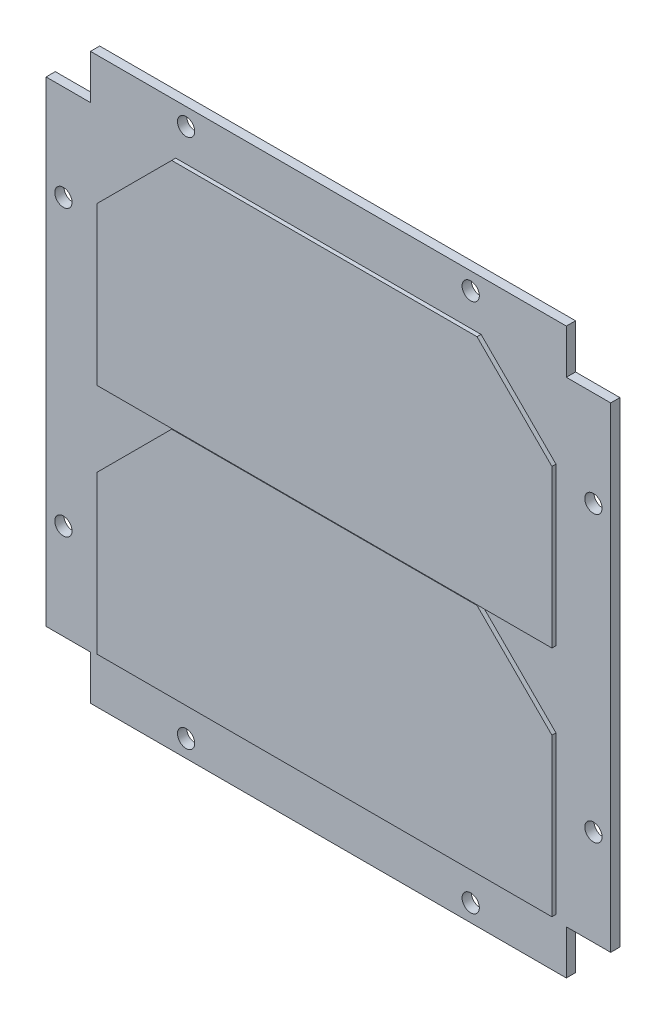
ISO-10303-21;
HEADER;
FILE_DESCRIPTION(('STEP AP214'),'2;1');
FILE_NAME('part.step','',(''),(''),'','','');
FILE_SCHEMA(('AUTOMOTIVE_DESIGN { 1 0 10303 214 1 1 1 1 }'));
ENDSEC;
DATA;
#1=APPLICATION_CONTEXT('core data for automotive mechanical design processes');
#2=APPLICATION_PROTOCOL_DEFINITION('international standard','automotive_design',2000,#1);
#3=PRODUCT_CONTEXT('',#1,'mechanical');
#4=PRODUCT('Part','Part','',(#3));
#5=PRODUCT_RELATED_PRODUCT_CATEGORY('part','',(#4));
#6=PRODUCT_DEFINITION_FORMATION('','',#4);
#7=PRODUCT_DEFINITION_CONTEXT('part definition',#1,'design');
#8=PRODUCT_DEFINITION('design','',#6,#7);
#9=PRODUCT_DEFINITION_SHAPE('','',#8);
#10=(LENGTH_UNIT() NAMED_UNIT(*) SI_UNIT(.MILLI.,.METRE.));
#11=(NAMED_UNIT(*) PLANE_ANGLE_UNIT() SI_UNIT($,.RADIAN.));
#12=(NAMED_UNIT(*) SI_UNIT($,.STERADIAN.) SOLID_ANGLE_UNIT());
#13=UNCERTAINTY_MEASURE_WITH_UNIT(LENGTH_MEASURE(1.E-05),#10,'distance_accuracy_value','');
#14=(GEOMETRIC_REPRESENTATION_CONTEXT(3) GLOBAL_UNCERTAINTY_ASSIGNED_CONTEXT((#13)) GLOBAL_UNIT_ASSIGNED_CONTEXT((#10,
#11,#12)) REPRESENTATION_CONTEXT('',''));
#15=CARTESIAN_POINT('',(0.,0.,0.));
#16=DIRECTION('',(0.,0.,1.));
#17=DIRECTION('',(1.,0.,0.));
#18=AXIS2_PLACEMENT_3D('',#15,#16,#17);
#19=CARTESIAN_POINT('',(0.,0.,1.6));
#20=DIRECTION('',(0.,0.,1.));
#21=DIRECTION('',(1.,0.,0.));
#22=AXIS2_PLACEMENT_3D('',#19,#20,#21);
#23=PLANE('',#22);
#24=CARTESIAN_POINT('',(0.817350233556478,40.8722046309123,1.6));
#25=DIRECTION('',(0.,0.,1.));
#26=DIRECTION('',(1.,0.,0.));
#27=AXIS2_PLACEMENT_3D('',#24,#25,#26);
#28=CIRCLE('',#27,1.5);
#29=CARTESIAN_POINT('',(2.31735023355648,40.8722046309123,1.6));
#30=VERTEX_POINT('',#29);
#31=EDGE_CURVE('E334',#30,#30,#28,.T.);
#32=ORIENTED_EDGE('',*,*,#31,.F.);
#33=EDGE_LOOP('',(#32));
#34=FACE_BOUND('',#33,.T.);
#35=CARTESIAN_POINT('',(22.1173502335565,-29.8277953690877,1.6));
#36=DIRECTION('',(0.,0.,1.));
#37=DIRECTION('',(1.,0.,0.));
#38=AXIS2_PLACEMENT_3D('',#35,#36,#37);
#39=CIRCLE('',#38,1.5);
#40=CARTESIAN_POINT('',(23.6173502335565,-29.8277953690877,1.6));
#41=VERTEX_POINT('',#40);
#42=EDGE_CURVE('E322',#41,#41,#39,.T.);
#43=ORIENTED_EDGE('',*,*,#42,.F.);
#44=EDGE_LOOP('',(#43));
#45=FACE_BOUND('',#44,.T.);
#46=CARTESIAN_POINT('',(-48.5826497664435,-51.1277953690877,1.6));
#47=DIRECTION('',(0.,0.,1.));
#48=DIRECTION('',(1.,0.,0.));
#49=AXIS2_PLACEMENT_3D('',#46,#47,#48);
#50=CIRCLE('',#49,1.5);
#51=CARTESIAN_POINT('',(-47.0826497664435,-51.1277953690877,1.6));
#52=VERTEX_POINT('',#51);
#53=EDGE_CURVE('E310',#52,#52,#50,.T.);
#54=ORIENTED_EDGE('',*,*,#53,.F.);
#55=EDGE_LOOP('',(#54));
#56=FACE_BOUND('',#55,.T.);
#57=CARTESIAN_POINT('',(-69.8826497664435,19.5722046309123,1.6));
#58=DIRECTION('',(0.,0.,1.));
#59=DIRECTION('',(1.,0.,0.));
#60=AXIS2_PLACEMENT_3D('',#57,#58,#59);
#61=CIRCLE('',#60,1.5);
#62=CARTESIAN_POINT('',(-68.3826497664435,19.5722046309123,1.6));
#63=VERTEX_POINT('',#62);
#64=EDGE_CURVE('E300',#63,#63,#61,.T.);
#65=ORIENTED_EDGE('',*,*,#64,.F.);
#66=EDGE_LOOP('',(#65));
#67=FACE_BOUND('',#66,.T.);
#68=DIRECTION('',(-1.,0.,0.));
#69=VECTOR('',#68,1.);
#70=CARTESIAN_POINT('',(17.4173502335565,43.8722046309123,1.6));
#71=LINE('',#70,#69);
#72=CARTESIAN_POINT('',(17.4173502335565,43.8722046309123,1.6));
#73=VERTEX_POINT('',#72);
#74=CARTESIAN_POINT('',(-65.1826497664435,43.8722046309123,1.6));
#75=VERTEX_POINT('',#74);
#76=EDGE_CURVE('E195',#73,#75,#71,.T.);
#77=ORIENTED_EDGE('',*,*,#76,.T.);
#78=DIRECTION('',(0.,-1.,0.));
#79=VECTOR('',#78,1.);
#80=CARTESIAN_POINT('',(-65.1826497664435,43.8722046309123,1.6));
#81=LINE('',#80,#79);
#82=CARTESIAN_POINT('',(-65.1826497664435,36.1722046309123,1.6));
#83=VERTEX_POINT('',#82);
#84=EDGE_CURVE('E118',#75,#83,#81,.T.);
#85=ORIENTED_EDGE('',*,*,#84,.T.);
#86=DIRECTION('',(-1.,0.,0.));
#87=VECTOR('',#86,1.);
#88=CARTESIAN_POINT('',(-65.1826497664435,36.1722046309123,1.6));
#89=LINE('',#88,#87);
#90=CARTESIAN_POINT('',(-72.8826497664435,36.1722046309123,1.6));
#91=VERTEX_POINT('',#90);
#92=EDGE_CURVE('E222',#83,#91,#89,.T.);
#93=ORIENTED_EDGE('',*,*,#92,.T.);
#94=DIRECTION('',(0.,-1.,0.));
#95=VECTOR('',#94,1.);
#96=CARTESIAN_POINT('',(-72.8826497664435,36.1722046309123,1.6));
#97=LINE('',#96,#95);
#98=CARTESIAN_POINT('',(-72.8826497664435,-46.4277953690877,1.6));
#99=VERTEX_POINT('',#98);
#100=EDGE_CURVE('E241',#91,#99,#97,.T.);
#101=ORIENTED_EDGE('',*,*,#100,.T.);
#102=DIRECTION('',(1.,0.,0.));
#103=VECTOR('',#102,1.);
#104=CARTESIAN_POINT('',(-72.8826497664435,-46.4277953690877,1.6));
#105=LINE('',#104,#103);
#106=CARTESIAN_POINT('',(-65.1826497664435,-46.4277953690877,1.6));
#107=VERTEX_POINT('',#106);
#108=EDGE_CURVE('E238',#99,#107,#105,.T.);
#109=ORIENTED_EDGE('',*,*,#108,.T.);
#110=DIRECTION('',(0.,-1.,0.));
#111=VECTOR('',#110,1.);
#112=CARTESIAN_POINT('',(-65.1826497664435,-46.4277953690877,1.6));
#113=LINE('',#112,#111);
#114=CARTESIAN_POINT('',(-65.1826497664435,-54.1277953690877,1.6));
#115=VERTEX_POINT('',#114);
#116=EDGE_CURVE('E240',#107,#115,#113,.T.);
#117=ORIENTED_EDGE('',*,*,#116,.T.);
#118=DIRECTION('',(1.,0.,0.));
#119=VECTOR('',#118,1.);
#120=CARTESIAN_POINT('',(-65.1826497664435,-54.1277953690877,1.6));
#121=LINE('',#120,#119);
#122=CARTESIAN_POINT('',(17.4173502335565,-54.1277953690877,1.6));
#123=VERTEX_POINT('',#122);
#124=EDGE_CURVE('E243',#115,#123,#121,.T.);
#125=ORIENTED_EDGE('',*,*,#124,.T.);
#126=DIRECTION('',(0.,1.,0.));
#127=VECTOR('',#126,1.);
#128=CARTESIAN_POINT('',(17.4173502335565,-54.1277953690877,1.6));
#129=LINE('',#128,#127);
#130=CARTESIAN_POINT('',(17.4173502335565,-46.4277953690877,1.6));
#131=VERTEX_POINT('',#130);
#132=EDGE_CURVE('E249',#123,#131,#129,.T.);
#133=ORIENTED_EDGE('',*,*,#132,.T.);
#134=DIRECTION('',(1.,0.,0.));
#135=VECTOR('',#134,1.);
#136=CARTESIAN_POINT('',(17.4173502335565,-46.4277953690877,1.6));
#137=LINE('',#136,#135);
#138=CARTESIAN_POINT('',(25.1173502335565,-46.4277953690877,1.6));
#139=VERTEX_POINT('',#138);
#140=EDGE_CURVE('E151',#131,#139,#137,.T.);
#141=ORIENTED_EDGE('',*,*,#140,.T.);
#142=DIRECTION('',(0.,1.,0.));
#143=VECTOR('',#142,1.);
#144=CARTESIAN_POINT('',(25.1173502335565,-46.4277953690877,1.6));
#145=LINE('',#144,#143);
#146=CARTESIAN_POINT('',(25.1173502335565,36.1722046309123,1.6));
#147=VERTEX_POINT('',#146);
#148=EDGE_CURVE('E145',#139,#147,#145,.T.);
#149=ORIENTED_EDGE('',*,*,#148,.T.);
#150=DIRECTION('',(-1.,0.,0.));
#151=VECTOR('',#150,1.);
#152=CARTESIAN_POINT('',(25.1173502335565,36.1722046309123,1.6));
#153=LINE('',#152,#151);
#154=CARTESIAN_POINT('',(17.4173502335565,36.1722046309123,1.6));
#155=VERTEX_POINT('',#154);
#156=EDGE_CURVE('E148',#147,#155,#153,.T.);
#157=ORIENTED_EDGE('',*,*,#156,.T.);
#158=DIRECTION('',(0.,1.,0.));
#159=VECTOR('',#158,1.);
#160=CARTESIAN_POINT('',(17.4173502335565,36.1722046309123,1.6));
#161=LINE('',#160,#159);
#162=EDGE_CURVE('E65',#155,#73,#161,.T.);
#163=ORIENTED_EDGE('',*,*,#162,.T.);
#164=EDGE_LOOP('',(#77,#85,#93,#101,#109,#117,#125,#133,#141,#149,#157,#163));
#165=FACE_BOUND('',#164,.T.);
#166=DIRECTION('',(1.,0.,0.));
#167=VECTOR('',#166,1.);
#168=CARTESIAN_POINT('',(15.6173502335565,-5.07779536908768,1.6));
#169=LINE('',#168,#167);
#170=CARTESIAN_POINT('',(-63.3826497664435,-5.07779536908768,1.6));
#171=VERTEX_POINT('',#170);
#172=CARTESIAN_POINT('',(15.6173502335565,-5.07779536908768,1.6));
#173=VERTEX_POINT('',#172);
#174=EDGE_CURVE('E276',#171,#173,#169,.T.);
#175=ORIENTED_EDGE('',*,*,#174,.F.);
#176=DIRECTION('',(0.,-1.,0.));
#177=VECTOR('',#176,1.);
#178=CARTESIAN_POINT('',(-63.3826497664435,-5.07779536908768,1.6));
#179=LINE('',#178,#177);
#180=CARTESIAN_POINT('',(-63.3826497664435,22.2222046309123,1.6));
#181=VERTEX_POINT('',#180);
#182=EDGE_CURVE('E279',#181,#171,#179,.T.);
#183=ORIENTED_EDGE('',*,*,#182,.F.);
#184=DIRECTION('',(-0.707106781186547,-0.707106781186547,0.));
#185=VECTOR('',#184,1.);
#186=CARTESIAN_POINT('',(-63.3826497664435,22.2222046309123,1.6));
#187=LINE('',#186,#185);
#188=CARTESIAN_POINT('',(-50.3826497664435,35.2222046309123,1.6));
#189=VERTEX_POINT('',#188);
#190=EDGE_CURVE('E56',#189,#181,#187,.T.);
#191=ORIENTED_EDGE('',*,*,#190,.F.);
#192=DIRECTION('',(-1.,0.,0.));
#193=VECTOR('',#192,1.);
#194=CARTESIAN_POINT('',(-50.3826497664435,35.2222046309123,1.6));
#195=LINE('',#194,#193);
#196=CARTESIAN_POINT('',(2.61735023355648,35.2222046309123,1.6));
#197=VERTEX_POINT('',#196);
#198=EDGE_CURVE('E268',#197,#189,#195,.T.);
#199=ORIENTED_EDGE('',*,*,#198,.F.);
#200=DIRECTION('',(-0.707106781186547,0.707106781186547,0.));
#201=VECTOR('',#200,1.);
#202=CARTESIAN_POINT('',(2.61735023355648,35.2222046309123,1.6));
#203=LINE('',#202,#201);
#204=CARTESIAN_POINT('',(15.6173502335565,22.2222046309123,1.6));
#205=VERTEX_POINT('',#204);
#206=EDGE_CURVE('E270',#205,#197,#203,.T.);
#207=ORIENTED_EDGE('',*,*,#206,.F.);
#208=DIRECTION('',(0.,1.,0.));
#209=VECTOR('',#208,1.);
#210=CARTESIAN_POINT('',(15.6173502335565,22.2222046309123,1.6));
#211=LINE('',#210,#209);
#212=EDGE_CURVE('E273',#173,#205,#211,.T.);
#213=ORIENTED_EDGE('',*,*,#212,.F.);
#214=EDGE_LOOP('',(#175,#183,#191,#199,#207,#213));
#215=FACE_BOUND('',#214,.T.);
#216=DIRECTION('',(1.,0.,0.));
#217=VECTOR('',#216,1.);
#218=CARTESIAN_POINT('',(15.6173502335565,-45.4777953690877,1.6));
#219=LINE('',#218,#217);
#220=CARTESIAN_POINT('',(-63.3826497664435,-45.4777953690877,1.6));
#221=VERTEX_POINT('',#220);
#222=CARTESIAN_POINT('',(15.6173502335565,-45.4777953690877,1.6));
#223=VERTEX_POINT('',#222);
#224=EDGE_CURVE('E294',#221,#223,#219,.T.);
#225=ORIENTED_EDGE('',*,*,#224,.F.);
#226=DIRECTION('',(0.,-1.,0.));
#227=VECTOR('',#226,1.);
#228=CARTESIAN_POINT('',(-63.3826497664435,-18.1777953690877,1.6));
#229=LINE('',#228,#227);
#230=CARTESIAN_POINT('',(-63.3826497664435,-18.1777953690877,1.6));
#231=VERTEX_POINT('',#230);
#232=EDGE_CURVE('E297',#231,#221,#229,.T.);
#233=ORIENTED_EDGE('',*,*,#232,.F.);
#234=DIRECTION('',(-0.707106781186547,-0.707106781186548,0.));
#235=VECTOR('',#234,1.);
#236=CARTESIAN_POINT('',(-63.3826497664435,-18.1777953690877,1.6));
#237=LINE('',#236,#235);
#238=CARTESIAN_POINT('',(-50.3826497664435,-5.17779536908769,1.6));
#239=VERTEX_POINT('',#238);
#240=EDGE_CURVE('E282',#239,#231,#237,.T.);
#241=ORIENTED_EDGE('',*,*,#240,.F.);
#242=DIRECTION('',(-1.,0.,0.));
#243=VECTOR('',#242,1.);
#244=CARTESIAN_POINT('',(-50.3826497664435,-5.17779536908768,1.6));
#245=LINE('',#244,#243);
#246=CARTESIAN_POINT('',(2.61735023355649,-5.17779536908768,1.6));
#247=VERTEX_POINT('',#246);
#248=EDGE_CURVE('E285',#247,#239,#245,.T.);
#249=ORIENTED_EDGE('',*,*,#248,.F.);
#250=DIRECTION('',(-0.707106781186548,0.707106781186547,0.));
#251=VECTOR('',#250,1.);
#252=CARTESIAN_POINT('',(2.61735023355649,-5.17779536908768,1.6));
#253=LINE('',#252,#251);
#254=CARTESIAN_POINT('',(15.6173502335565,-18.1777953690877,1.6));
#255=VERTEX_POINT('',#254);
#256=EDGE_CURVE('E288',#255,#247,#253,.T.);
#257=ORIENTED_EDGE('',*,*,#256,.F.);
#258=DIRECTION('',(0.,1.,0.));
#259=VECTOR('',#258,1.);
#260=CARTESIAN_POINT('',(15.6173502335565,-18.1777953690877,1.6));
#261=LINE('',#260,#259);
#262=EDGE_CURVE('E291',#223,#255,#261,.T.);
#263=ORIENTED_EDGE('',*,*,#262,.F.);
#264=EDGE_LOOP('',(#225,#233,#241,#249,#257,#263));
#265=FACE_BOUND('',#264,.T.);
#266=CARTESIAN_POINT('',(-69.8826497664435,-29.8277953690877,1.6));
#267=DIRECTION('',(0.,0.,1.));
#268=DIRECTION('',(1.,0.,0.));
#269=AXIS2_PLACEMENT_3D('',#266,#267,#268);
#270=CIRCLE('',#269,1.5);
#271=CARTESIAN_POINT('',(-68.3826497664435,-29.8277953690877,1.6));
#272=VERTEX_POINT('',#271);
#273=EDGE_CURVE('E304',#272,#272,#270,.T.);
#274=ORIENTED_EDGE('',*,*,#273,.F.);
#275=EDGE_LOOP('',(#274));
#276=FACE_BOUND('',#275,.T.);
#277=CARTESIAN_POINT('',(0.817350233556485,-51.1277953690877,1.6));
#278=DIRECTION('',(0.,0.,1.));
#279=DIRECTION('',(1.,0.,0.));
#280=AXIS2_PLACEMENT_3D('',#277,#278,#279);
#281=CIRCLE('',#280,1.5);
#282=CARTESIAN_POINT('',(2.31735023355649,-51.1277953690877,1.6));
#283=VERTEX_POINT('',#282);
#284=EDGE_CURVE('E316',#283,#283,#281,.T.);
#285=ORIENTED_EDGE('',*,*,#284,.F.);
#286=EDGE_LOOP('',(#285));
#287=FACE_BOUND('',#286,.T.);
#288=CARTESIAN_POINT('',(22.1173502335565,19.5722046309123,1.6));
#289=DIRECTION('',(0.,0.,1.));
#290=DIRECTION('',(1.,0.,0.));
#291=AXIS2_PLACEMENT_3D('',#288,#289,#290);
#292=CIRCLE('',#291,1.5);
#293=CARTESIAN_POINT('',(23.6173502335565,19.5722046309123,1.6));
#294=VERTEX_POINT('',#293);
#295=EDGE_CURVE('E328',#294,#294,#292,.T.);
#296=ORIENTED_EDGE('',*,*,#295,.F.);
#297=EDGE_LOOP('',(#296));
#298=FACE_BOUND('',#297,.T.);
#299=CARTESIAN_POINT('',(-48.5826497664435,40.8722046309123,1.6));
#300=DIRECTION('',(0.,0.,1.));
#301=DIRECTION('',(1.,0.,0.));
#302=AXIS2_PLACEMENT_3D('',#299,#300,#301);
#303=CIRCLE('',#302,1.5);
#304=CARTESIAN_POINT('',(-47.0826497664435,40.8722046309123,1.6));
#305=VERTEX_POINT('',#304);
#306=EDGE_CURVE('E340',#305,#305,#303,.T.);
#307=ORIENTED_EDGE('',*,*,#306,.F.);
#308=EDGE_LOOP('',(#307));
#309=FACE_BOUND('',#308,.T.);
#310=ADVANCED_FACE('F41',(#34,#45,#56,#67,#165,#215,#265,#276,#287,#298,#309),#23,.T.);
#311=CARTESIAN_POINT('',(0.,0.,0.));
#312=DIRECTION('',(0.,0.,1.));
#313=DIRECTION('',(1.,0.,0.));
#314=AXIS2_PLACEMENT_3D('',#311,#312,#313);
#315=PLANE('',#314);
#316=DIRECTION('',(-1.,0.,0.));
#317=VECTOR('',#316,1.);
#318=CARTESIAN_POINT('',(17.4173502335565,43.8722046309123,0.));
#319=LINE('',#318,#317);
#320=CARTESIAN_POINT('',(17.4173502335565,43.8722046309123,0.));
#321=VERTEX_POINT('',#320);
#322=CARTESIAN_POINT('',(-65.1826497664435,43.8722046309123,0.));
#323=VERTEX_POINT('',#322);
#324=EDGE_CURVE('E172',#321,#323,#319,.T.);
#325=ORIENTED_EDGE('',*,*,#324,.F.);
#326=DIRECTION('',(0.,1.,0.));
#327=VECTOR('',#326,1.);
#328=CARTESIAN_POINT('',(17.4173502335565,36.1722046309123,0.));
#329=LINE('',#328,#327);
#330=CARTESIAN_POINT('',(17.4173502335565,36.1722046309123,0.));
#331=VERTEX_POINT('',#330);
#332=EDGE_CURVE('E110',#331,#321,#329,.T.);
#333=ORIENTED_EDGE('',*,*,#332,.F.);
#334=DIRECTION('',(-1.,0.,0.));
#335=VECTOR('',#334,1.);
#336=CARTESIAN_POINT('',(25.1173502335565,36.1722046309123,0.));
#337=LINE('',#336,#335);
#338=CARTESIAN_POINT('',(25.1173502335565,36.1722046309123,0.));
#339=VERTEX_POINT('',#338);
#340=EDGE_CURVE('E192',#339,#331,#337,.T.);
#341=ORIENTED_EDGE('',*,*,#340,.F.);
#342=DIRECTION('',(0.,1.,0.));
#343=VECTOR('',#342,1.);
#344=CARTESIAN_POINT('',(25.1173502335565,-46.4277953690877,0.));
#345=LINE('',#344,#343);
#346=CARTESIAN_POINT('',(25.1173502335565,-46.4277953690877,0.));
#347=VERTEX_POINT('',#346);
#348=EDGE_CURVE('E160',#347,#339,#345,.T.);
#349=ORIENTED_EDGE('',*,*,#348,.F.);
#350=DIRECTION('',(1.,0.,0.));
#351=VECTOR('',#350,1.);
#352=CARTESIAN_POINT('',(17.4173502335565,-46.4277953690877,0.));
#353=LINE('',#352,#351);
#354=CARTESIAN_POINT('',(17.4173502335565,-46.4277953690877,0.));
#355=VERTEX_POINT('',#354);
#356=EDGE_CURVE('E189',#355,#347,#353,.T.);
#357=ORIENTED_EDGE('',*,*,#356,.F.);
#358=DIRECTION('',(0.,1.,0.));
#359=VECTOR('',#358,1.);
#360=CARTESIAN_POINT('',(17.4173502335565,-54.1277953690877,0.));
#361=LINE('',#360,#359);
#362=CARTESIAN_POINT('',(17.4173502335565,-54.1277953690877,0.));
#363=VERTEX_POINT('',#362);
#364=EDGE_CURVE('E187',#363,#355,#361,.T.);
#365=ORIENTED_EDGE('',*,*,#364,.F.);
#366=DIRECTION('',(1.,0.,0.));
#367=VECTOR('',#366,1.);
#368=CARTESIAN_POINT('',(-65.1826497664435,-54.1277953690877,0.));
#369=LINE('',#368,#367);
#370=CARTESIAN_POINT('',(-65.1826497664435,-54.1277953690877,0.));
#371=VERTEX_POINT('',#370);
#372=EDGE_CURVE('E185',#371,#363,#369,.T.);
#373=ORIENTED_EDGE('',*,*,#372,.F.);
#374=DIRECTION('',(0.,-1.,0.));
#375=VECTOR('',#374,1.);
#376=CARTESIAN_POINT('',(-65.1826497664435,-46.4277953690877,0.));
#377=LINE('',#376,#375);
#378=CARTESIAN_POINT('',(-65.1826497664435,-46.4277953690877,0.));
#379=VERTEX_POINT('',#378);
#380=EDGE_CURVE('E183',#379,#371,#377,.T.);
#381=ORIENTED_EDGE('',*,*,#380,.F.);
#382=DIRECTION('',(1.,0.,0.));
#383=VECTOR('',#382,1.);
#384=CARTESIAN_POINT('',(-72.8826497664435,-46.4277953690877,0.));
#385=LINE('',#384,#383);
#386=CARTESIAN_POINT('',(-72.8826497664435,-46.4277953690877,0.));
#387=VERTEX_POINT('',#386);
#388=EDGE_CURVE('E181',#387,#379,#385,.T.);
#389=ORIENTED_EDGE('',*,*,#388,.F.);
#390=DIRECTION('',(0.,-1.,0.));
#391=VECTOR('',#390,1.);
#392=CARTESIAN_POINT('',(-72.8826497664435,36.1722046309123,0.));
#393=LINE('',#392,#391);
#394=CARTESIAN_POINT('',(-72.8826497664435,36.1722046309123,0.));
#395=VERTEX_POINT('',#394);
#396=EDGE_CURVE('E179',#395,#387,#393,.T.);
#397=ORIENTED_EDGE('',*,*,#396,.F.);
#398=DIRECTION('',(-1.,0.,0.));
#399=VECTOR('',#398,1.);
#400=CARTESIAN_POINT('',(-65.1826497664435,36.1722046309123,0.));
#401=LINE('',#400,#399);
#402=CARTESIAN_POINT('',(-65.1826497664435,36.1722046309123,0.));
#403=VERTEX_POINT('',#402);
#404=EDGE_CURVE('E177',#403,#395,#401,.T.);
#405=ORIENTED_EDGE('',*,*,#404,.F.);
#406=DIRECTION('',(0.,-1.,0.));
#407=VECTOR('',#406,1.);
#408=CARTESIAN_POINT('',(-65.1826497664435,43.8722046309123,0.));
#409=LINE('',#408,#407);
#410=EDGE_CURVE('E175',#323,#403,#409,.T.);
#411=ORIENTED_EDGE('',*,*,#410,.F.);
#412=EDGE_LOOP('',(#325,#333,#341,#349,#357,#365,#373,#381,#389,#397,#405,#411));
#413=FACE_BOUND('',#412,.T.);
#414=CARTESIAN_POINT('',(-69.8826497664435,19.5722046309123,0.));
#415=DIRECTION('',(0.,0.,1.));
#416=DIRECTION('',(1.,0.,0.));
#417=AXIS2_PLACEMENT_3D('',#414,#415,#416);
#418=CIRCLE('',#417,1.5);
#419=CARTESIAN_POINT('',(-68.3826497664435,19.5722046309123,0.));
#420=VERTEX_POINT('',#419);
#421=EDGE_CURVE('E301',#420,#420,#418,.T.);
#422=ORIENTED_EDGE('',*,*,#421,.T.);
#423=EDGE_LOOP('',(#422));
#424=FACE_BOUND('',#423,.T.);
#425=CARTESIAN_POINT('',(-69.8826497664435,-29.8277953690877,0.));
#426=DIRECTION('',(0.,0.,1.));
#427=DIRECTION('',(1.,0.,0.));
#428=AXIS2_PLACEMENT_3D('',#425,#426,#427);
#429=CIRCLE('',#428,1.5);
#430=CARTESIAN_POINT('',(-68.3826497664435,-29.8277953690877,0.));
#431=VERTEX_POINT('',#430);
#432=EDGE_CURVE('E307',#431,#431,#429,.T.);
#433=ORIENTED_EDGE('',*,*,#432,.T.);
#434=EDGE_LOOP('',(#433));
#435=FACE_BOUND('',#434,.T.);
#436=CARTESIAN_POINT('',(-48.5826497664435,-51.1277953690877,0.));
#437=DIRECTION('',(0.,0.,1.));
#438=DIRECTION('',(1.,0.,0.));
#439=AXIS2_PLACEMENT_3D('',#436,#437,#438);
#440=CIRCLE('',#439,1.5);
#441=CARTESIAN_POINT('',(-47.0826497664435,-51.1277953690877,0.));
#442=VERTEX_POINT('',#441);
#443=EDGE_CURVE('E313',#442,#442,#440,.T.);
#444=ORIENTED_EDGE('',*,*,#443,.T.);
#445=EDGE_LOOP('',(#444));
#446=FACE_BOUND('',#445,.T.);
#447=CARTESIAN_POINT('',(0.817350233556485,-51.1277953690877,0.));
#448=DIRECTION('',(0.,0.,1.));
#449=DIRECTION('',(1.,0.,0.));
#450=AXIS2_PLACEMENT_3D('',#447,#448,#449);
#451=CIRCLE('',#450,1.5);
#452=CARTESIAN_POINT('',(2.31735023355649,-51.1277953690877,0.));
#453=VERTEX_POINT('',#452);
#454=EDGE_CURVE('E319',#453,#453,#451,.T.);
#455=ORIENTED_EDGE('',*,*,#454,.T.);
#456=EDGE_LOOP('',(#455));
#457=FACE_BOUND('',#456,.T.);
#458=CARTESIAN_POINT('',(22.1173502335565,-29.8277953690877,0.));
#459=DIRECTION('',(0.,0.,1.));
#460=DIRECTION('',(1.,0.,0.));
#461=AXIS2_PLACEMENT_3D('',#458,#459,#460);
#462=CIRCLE('',#461,1.5);
#463=CARTESIAN_POINT('',(23.6173502335565,-29.8277953690877,0.));
#464=VERTEX_POINT('',#463);
#465=EDGE_CURVE('E325',#464,#464,#462,.T.);
#466=ORIENTED_EDGE('',*,*,#465,.T.);
#467=EDGE_LOOP('',(#466));
#468=FACE_BOUND('',#467,.T.);
#469=CARTESIAN_POINT('',(22.1173502335565,19.5722046309123,0.));
#470=DIRECTION('',(0.,0.,1.));
#471=DIRECTION('',(1.,0.,0.));
#472=AXIS2_PLACEMENT_3D('',#469,#470,#471);
#473=CIRCLE('',#472,1.5);
#474=CARTESIAN_POINT('',(23.6173502335565,19.5722046309123,0.));
#475=VERTEX_POINT('',#474);
#476=EDGE_CURVE('E331',#475,#475,#473,.T.);
#477=ORIENTED_EDGE('',*,*,#476,.T.);
#478=EDGE_LOOP('',(#477));
#479=FACE_BOUND('',#478,.T.);
#480=CARTESIAN_POINT('',(0.817350233556478,40.8722046309123,0.));
#481=DIRECTION('',(0.,0.,1.));
#482=DIRECTION('',(1.,0.,0.));
#483=AXIS2_PLACEMENT_3D('',#480,#481,#482);
#484=CIRCLE('',#483,1.5);
#485=CARTESIAN_POINT('',(2.31735023355648,40.8722046309123,0.));
#486=VERTEX_POINT('',#485);
#487=EDGE_CURVE('E337',#486,#486,#484,.T.);
#488=ORIENTED_EDGE('',*,*,#487,.T.);
#489=EDGE_LOOP('',(#488));
#490=FACE_BOUND('',#489,.T.);
#491=CARTESIAN_POINT('',(-48.5826497664435,40.8722046309123,0.));
#492=DIRECTION('',(0.,0.,1.));
#493=DIRECTION('',(1.,0.,0.));
#494=AXIS2_PLACEMENT_3D('',#491,#492,#493);
#495=CIRCLE('',#494,1.5);
#496=CARTESIAN_POINT('',(-47.0826497664435,40.8722046309123,0.));
#497=VERTEX_POINT('',#496);
#498=EDGE_CURVE('E343',#497,#497,#495,.T.);
#499=ORIENTED_EDGE('',*,*,#498,.T.);
#500=EDGE_LOOP('',(#499));
#501=FACE_BOUND('',#500,.T.);
#502=ADVANCED_FACE('F226',(#413,#424,#435,#446,#457,#468,#479,#490,#501),#315,.F.);
#503=CARTESIAN_POINT('',(17.4173502335565,43.8722046309123,1.6));
#504=DIRECTION('',(0.,-1.,0.));
#505=DIRECTION('',(1.,0.,0.));
#506=AXIS2_PLACEMENT_3D('',#503,#504,#505);
#507=PLANE('',#506);
#508=ORIENTED_EDGE('',*,*,#324,.T.);
#509=DIRECTION('',(0.,0.,-1.));
#510=VECTOR('',#509,1.);
#511=CARTESIAN_POINT('',(-65.1826497664435,43.8722046309123,1.6));
#512=LINE('',#511,#510);
#513=EDGE_CURVE('E11',#75,#323,#512,.T.);
#514=ORIENTED_EDGE('',*,*,#513,.F.);
#515=ORIENTED_EDGE('',*,*,#76,.F.);
#516=DIRECTION('',(0.,0.,-1.));
#517=VECTOR('',#516,1.);
#518=CARTESIAN_POINT('',(17.4173502335565,43.8722046309123,1.6));
#519=LINE('',#518,#517);
#520=EDGE_CURVE('E168',#73,#321,#519,.T.);
#521=ORIENTED_EDGE('',*,*,#520,.T.);
#522=EDGE_LOOP('',(#508,#514,#515,#521));
#523=FACE_BOUND('',#522,.T.);
#524=ADVANCED_FACE('F43',(#523),#507,.F.);
#525=CARTESIAN_POINT('',(-65.1826497664435,43.8722046309123,1.6));
#526=DIRECTION('',(1.,0.,0.));
#527=DIRECTION('',(0.,0.,-1.));
#528=AXIS2_PLACEMENT_3D('',#525,#526,#527);
#529=PLANE('',#528);
#530=ORIENTED_EDGE('',*,*,#410,.T.);
#531=DIRECTION('',(0.,0.,-1.));
#532=VECTOR('',#531,1.);
#533=CARTESIAN_POINT('',(-65.1826497664435,36.1722046309123,1.6));
#534=LINE('',#533,#532);
#535=EDGE_CURVE('E49',#83,#403,#534,.T.);
#536=ORIENTED_EDGE('',*,*,#535,.F.);
#537=ORIENTED_EDGE('',*,*,#84,.F.);
#538=ORIENTED_EDGE('',*,*,#513,.T.);
#539=EDGE_LOOP('',(#530,#536,#537,#538));
#540=FACE_BOUND('',#539,.T.);
#541=ADVANCED_FACE('F555',(#540),#529,.F.);
#542=CARTESIAN_POINT('',(-65.1826497664435,36.1722046309123,1.6));
#543=DIRECTION('',(0.,-1.,0.));
#544=DIRECTION('',(0.,0.,-1.));
#545=AXIS2_PLACEMENT_3D('',#542,#543,#544);
#546=PLANE('',#545);
#547=ORIENTED_EDGE('',*,*,#404,.T.);
#548=DIRECTION('',(0.,0.,-1.));
#549=VECTOR('',#548,1.);
#550=CARTESIAN_POINT('',(-72.8826497664435,36.1722046309123,1.6));
#551=LINE('',#550,#549);
#552=EDGE_CURVE('E214',#91,#395,#551,.T.);
#553=ORIENTED_EDGE('',*,*,#552,.F.);
#554=ORIENTED_EDGE('',*,*,#92,.F.);
#555=ORIENTED_EDGE('',*,*,#535,.T.);
#556=EDGE_LOOP('',(#547,#553,#554,#555));
#557=FACE_BOUND('',#556,.T.);
#558=ADVANCED_FACE('F220',(#557),#546,.F.);
#559=CARTESIAN_POINT('',(-72.8826497664435,36.1722046309123,1.6));
#560=DIRECTION('',(1.,0.,0.));
#561=DIRECTION('',(0.,1.,0.));
#562=AXIS2_PLACEMENT_3D('',#559,#560,#561);
#563=PLANE('',#562);
#564=ORIENTED_EDGE('',*,*,#396,.T.);
#565=DIRECTION('',(0.,0.,-1.));
#566=VECTOR('',#565,1.);
#567=CARTESIAN_POINT('',(-72.8826497664435,-46.4277953690877,1.6));
#568=LINE('',#567,#566);
#569=EDGE_CURVE('E211',#99,#387,#568,.T.);
#570=ORIENTED_EDGE('',*,*,#569,.F.);
#571=ORIENTED_EDGE('',*,*,#100,.F.);
#572=ORIENTED_EDGE('',*,*,#552,.T.);
#573=EDGE_LOOP('',(#564,#570,#571,#572));
#574=FACE_BOUND('',#573,.T.);
#575=ADVANCED_FACE('F232',(#574),#563,.F.);
#576=CARTESIAN_POINT('',(-72.8826497664435,-46.4277953690877,1.6));
#577=DIRECTION('',(0.,1.,0.));
#578=DIRECTION('',(0.,0.,1.));
#579=AXIS2_PLACEMENT_3D('',#576,#577,#578);
#580=PLANE('',#579);
#581=ORIENTED_EDGE('',*,*,#388,.T.);
#582=DIRECTION('',(0.,0.,-1.));
#583=VECTOR('',#582,1.);
#584=CARTESIAN_POINT('',(-65.1826497664435,-46.4277953690877,1.6));
#585=LINE('',#584,#583);
#586=EDGE_CURVE('E208',#107,#379,#585,.T.);
#587=ORIENTED_EDGE('',*,*,#586,.F.);
#588=ORIENTED_EDGE('',*,*,#108,.F.);
#589=ORIENTED_EDGE('',*,*,#569,.T.);
#590=EDGE_LOOP('',(#581,#587,#588,#589));
#591=FACE_BOUND('',#590,.T.);
#592=ADVANCED_FACE('F236',(#591),#580,.F.);
#593=CARTESIAN_POINT('',(-65.1826497664435,-46.4277953690877,1.6));
#594=DIRECTION('',(1.,0.,0.));
#595=DIRECTION('',(0.,0.,-1.));
#596=AXIS2_PLACEMENT_3D('',#593,#594,#595);
#597=PLANE('',#596);
#598=ORIENTED_EDGE('',*,*,#380,.T.);
#599=DIRECTION('',(0.,0.,-1.));
#600=VECTOR('',#599,1.);
#601=CARTESIAN_POINT('',(-65.1826497664435,-54.1277953690877,1.6));
#602=LINE('',#601,#600);
#603=EDGE_CURVE('E205',#115,#371,#602,.T.);
#604=ORIENTED_EDGE('',*,*,#603,.F.);
#605=ORIENTED_EDGE('',*,*,#116,.F.);
#606=ORIENTED_EDGE('',*,*,#586,.T.);
#607=EDGE_LOOP('',(#598,#604,#605,#606));
#608=FACE_BOUND('',#607,.T.);
#609=ADVANCED_FACE('F545',(#608),#597,.F.);
#610=CARTESIAN_POINT('',(-65.1826497664435,-54.1277953690877,1.6));
#611=DIRECTION('',(0.,1.,0.));
#612=DIRECTION('',(0.,0.,1.));
#613=AXIS2_PLACEMENT_3D('',#610,#611,#612);
#614=PLANE('',#613);
#615=ORIENTED_EDGE('',*,*,#372,.T.);
#616=DIRECTION('',(0.,0.,-1.));
#617=VECTOR('',#616,1.);
#618=CARTESIAN_POINT('',(17.4173502335565,-54.1277953690877,1.6));
#619=LINE('',#618,#617);
#620=EDGE_CURVE('E202',#123,#363,#619,.T.);
#621=ORIENTED_EDGE('',*,*,#620,.F.);
#622=ORIENTED_EDGE('',*,*,#124,.F.);
#623=ORIENTED_EDGE('',*,*,#603,.T.);
#624=EDGE_LOOP('',(#615,#621,#622,#623));
#625=FACE_BOUND('',#624,.T.);
#626=ADVANCED_FACE('F542',(#625),#614,.F.);
#627=CARTESIAN_POINT('',(17.4173502335565,-54.1277953690877,1.6));
#628=DIRECTION('',(-1.,0.,0.));
#629=DIRECTION('',(0.,0.,1.));
#630=AXIS2_PLACEMENT_3D('',#627,#628,#629);
#631=PLANE('',#630);
#632=ORIENTED_EDGE('',*,*,#364,.T.);
#633=DIRECTION('',(0.,0.,-1.));
#634=VECTOR('',#633,1.);
#635=CARTESIAN_POINT('',(17.4173502335565,-46.4277953690877,1.6));
#636=LINE('',#635,#634);
#637=EDGE_CURVE('E199',#131,#355,#636,.T.);
#638=ORIENTED_EDGE('',*,*,#637,.F.);
#639=ORIENTED_EDGE('',*,*,#132,.F.);
#640=ORIENTED_EDGE('',*,*,#620,.T.);
#641=EDGE_LOOP('',(#632,#638,#639,#640));
#642=FACE_BOUND('',#641,.T.);
#643=ADVANCED_FACE('F255',(#642),#631,.F.);
#644=CARTESIAN_POINT('',(17.4173502335565,-46.4277953690877,1.6));
#645=DIRECTION('',(0.,1.,0.));
#646=DIRECTION('',(0.,0.,1.));
#647=AXIS2_PLACEMENT_3D('',#644,#645,#646);
#648=PLANE('',#647);
#649=ORIENTED_EDGE('',*,*,#356,.T.);
#650=DIRECTION('',(0.,0.,-1.));
#651=VECTOR('',#650,1.);
#652=CARTESIAN_POINT('',(25.1173502335565,-46.4277953690877,1.6));
#653=LINE('',#652,#651);
#654=EDGE_CURVE('E163',#139,#347,#653,.T.);
#655=ORIENTED_EDGE('',*,*,#654,.F.);
#656=ORIENTED_EDGE('',*,*,#140,.F.);
#657=ORIENTED_EDGE('',*,*,#637,.T.);
#658=EDGE_LOOP('',(#649,#655,#656,#657));
#659=FACE_BOUND('',#658,.T.);
#660=ADVANCED_FACE('F259',(#659),#648,.F.);
#661=CARTESIAN_POINT('',(25.1173502335565,-46.4277953690877,1.6));
#662=DIRECTION('',(-1.,0.,0.));
#663=DIRECTION('',(0.,-1.,0.));
#664=AXIS2_PLACEMENT_3D('',#661,#662,#663);
#665=PLANE('',#664);
#666=ORIENTED_EDGE('',*,*,#348,.T.);
#667=DIRECTION('',(0.,0.,-1.));
#668=VECTOR('',#667,1.);
#669=CARTESIAN_POINT('',(25.1173502335565,36.1722046309123,1.6));
#670=LINE('',#669,#668);
#671=EDGE_CURVE('E157',#147,#339,#670,.T.);
#672=ORIENTED_EDGE('',*,*,#671,.F.);
#673=ORIENTED_EDGE('',*,*,#148,.F.);
#674=ORIENTED_EDGE('',*,*,#654,.T.);
#675=EDGE_LOOP('',(#666,#672,#673,#674));
#676=FACE_BOUND('',#675,.T.);
#677=ADVANCED_FACE('F158',(#676),#665,.F.);
#678=CARTESIAN_POINT('',(25.1173502335565,36.1722046309123,1.6));
#679=DIRECTION('',(0.,-1.,0.));
#680=DIRECTION('',(1.,0.,0.));
#681=AXIS2_PLACEMENT_3D('',#678,#679,#680);
#682=PLANE('',#681);
#683=ORIENTED_EDGE('',*,*,#340,.T.);
#684=DIRECTION('',(0.,0.,-1.));
#685=VECTOR('',#684,1.);
#686=CARTESIAN_POINT('',(17.4173502335565,36.1722046309123,1.6));
#687=LINE('',#686,#685);
#688=EDGE_CURVE('E164',#155,#331,#687,.T.);
#689=ORIENTED_EDGE('',*,*,#688,.F.);
#690=ORIENTED_EDGE('',*,*,#156,.F.);
#691=ORIENTED_EDGE('',*,*,#671,.T.);
#692=EDGE_LOOP('',(#683,#689,#690,#691));
#693=FACE_BOUND('',#692,.T.);
#694=ADVANCED_FACE('F166',(#693),#682,.F.);
#695=CARTESIAN_POINT('',(17.4173502335565,36.1722046309123,1.6));
#696=DIRECTION('',(-1.,0.,0.));
#697=DIRECTION('',(0.,-1.,0.));
#698=AXIS2_PLACEMENT_3D('',#695,#696,#697);
#699=PLANE('',#698);
#700=ORIENTED_EDGE('',*,*,#332,.T.);
#701=ORIENTED_EDGE('',*,*,#520,.F.);
#702=ORIENTED_EDGE('',*,*,#162,.F.);
#703=ORIENTED_EDGE('',*,*,#688,.T.);
#704=EDGE_LOOP('',(#700,#701,#702,#703));
#705=FACE_BOUND('',#704,.T.);
#706=ADVANCED_FACE('F260',(#705),#699,.F.);
#707=CARTESIAN_POINT('',(-69.8826497664435,19.5722046309123,1.6));
#708=DIRECTION('',(0.,0.,-1.));
#709=DIRECTION('',(-1.,0.,0.));
#710=AXIS2_PLACEMENT_3D('',#707,#708,#709);
#711=CYLINDRICAL_SURFACE('',#710,1.5);
#712=ORIENTED_EDGE('',*,*,#64,.T.);
#713=EDGE_LOOP('',(#712));
#714=FACE_BOUND('',#713,.T.);
#715=ORIENTED_EDGE('',*,*,#421,.F.);
#716=EDGE_LOOP('',(#715));
#717=FACE_BOUND('',#716,.T.);
#718=ADVANCED_FACE('F529',(#714,#717),#711,.F.);
#719=CARTESIAN_POINT('',(-69.8826497664435,-29.8277953690877,1.6));
#720=DIRECTION('',(0.,0.,-1.));
#721=DIRECTION('',(-1.,0.,0.));
#722=AXIS2_PLACEMENT_3D('',#719,#720,#721);
#723=CYLINDRICAL_SURFACE('',#722,1.5);
#724=ORIENTED_EDGE('',*,*,#273,.T.);
#725=EDGE_LOOP('',(#724));
#726=FACE_BOUND('',#725,.T.);
#727=ORIENTED_EDGE('',*,*,#432,.F.);
#728=EDGE_LOOP('',(#727));
#729=FACE_BOUND('',#728,.T.);
#730=ADVANCED_FACE('F649',(#726,#729),#723,.F.);
#731=CARTESIAN_POINT('',(-48.5826497664435,-51.1277953690877,1.6));
#732=DIRECTION('',(0.,0.,-1.));
#733=DIRECTION('',(-1.,0.,0.));
#734=AXIS2_PLACEMENT_3D('',#731,#732,#733);
#735=CYLINDRICAL_SURFACE('',#734,1.5);
#736=ORIENTED_EDGE('',*,*,#53,.T.);
#737=EDGE_LOOP('',(#736));
#738=FACE_BOUND('',#737,.T.);
#739=ORIENTED_EDGE('',*,*,#443,.F.);
#740=EDGE_LOOP('',(#739));
#741=FACE_BOUND('',#740,.T.);
#742=ADVANCED_FACE('F638',(#738,#741),#735,.F.);
#743=CARTESIAN_POINT('',(0.817350233556485,-51.1277953690877,1.6));
#744=DIRECTION('',(0.,0.,-1.));
#745=DIRECTION('',(-1.,0.,0.));
#746=AXIS2_PLACEMENT_3D('',#743,#744,#745);
#747=CYLINDRICAL_SURFACE('',#746,1.5);
#748=ORIENTED_EDGE('',*,*,#284,.T.);
#749=EDGE_LOOP('',(#748));
#750=FACE_BOUND('',#749,.T.);
#751=ORIENTED_EDGE('',*,*,#454,.F.);
#752=EDGE_LOOP('',(#751));
#753=FACE_BOUND('',#752,.T.);
#754=ADVANCED_FACE('F625',(#750,#753),#747,.F.);
#755=CARTESIAN_POINT('',(22.1173502335565,-29.8277953690877,1.6));
#756=DIRECTION('',(0.,0.,-1.));
#757=DIRECTION('',(-1.,0.,0.));
#758=AXIS2_PLACEMENT_3D('',#755,#756,#757);
#759=CYLINDRICAL_SURFACE('',#758,1.5);
#760=ORIENTED_EDGE('',*,*,#42,.T.);
#761=EDGE_LOOP('',(#760));
#762=FACE_BOUND('',#761,.T.);
#763=ORIENTED_EDGE('',*,*,#465,.F.);
#764=EDGE_LOOP('',(#763));
#765=FACE_BOUND('',#764,.T.);
#766=ADVANCED_FACE('F613',(#762,#765),#759,.F.);
#767=CARTESIAN_POINT('',(22.1173502335565,19.5722046309123,1.6));
#768=DIRECTION('',(0.,0.,-1.));
#769=DIRECTION('',(-1.,0.,0.));
#770=AXIS2_PLACEMENT_3D('',#767,#768,#769);
#771=CYLINDRICAL_SURFACE('',#770,1.5);
#772=ORIENTED_EDGE('',*,*,#295,.T.);
#773=EDGE_LOOP('',(#772));
#774=FACE_BOUND('',#773,.T.);
#775=ORIENTED_EDGE('',*,*,#476,.F.);
#776=EDGE_LOOP('',(#775));
#777=FACE_BOUND('',#776,.T.);
#778=ADVANCED_FACE('F602',(#774,#777),#771,.F.);
#779=CARTESIAN_POINT('',(0.817350233556478,40.8722046309123,1.6));
#780=DIRECTION('',(0.,0.,-1.));
#781=DIRECTION('',(-1.,0.,0.));
#782=AXIS2_PLACEMENT_3D('',#779,#780,#781);
#783=CYLINDRICAL_SURFACE('',#782,1.5);
#784=ORIENTED_EDGE('',*,*,#31,.T.);
#785=EDGE_LOOP('',(#784));
#786=FACE_BOUND('',#785,.T.);
#787=ORIENTED_EDGE('',*,*,#487,.F.);
#788=EDGE_LOOP('',(#787));
#789=FACE_BOUND('',#788,.T.);
#790=ADVANCED_FACE('F589',(#786,#789),#783,.F.);
#791=CARTESIAN_POINT('',(-48.5826497664435,40.8722046309123,1.6));
#792=DIRECTION('',(0.,0.,-1.));
#793=DIRECTION('',(-1.,0.,0.));
#794=AXIS2_PLACEMENT_3D('',#791,#792,#793);
#795=CYLINDRICAL_SURFACE('',#794,1.5);
#796=ORIENTED_EDGE('',*,*,#306,.T.);
#797=EDGE_LOOP('',(#796));
#798=FACE_BOUND('',#797,.T.);
#799=ORIENTED_EDGE('',*,*,#498,.F.);
#800=EDGE_LOOP('',(#799));
#801=FACE_BOUND('',#800,.T.);
#802=ADVANCED_FACE('F584',(#798,#801),#795,.F.);
#803=CARTESIAN_POINT('',(-63.3826497664435,0.,2.3));
#804=DIRECTION('',(-1.,0.,0.));
#805=DIRECTION('',(0.,0.,1.));
#806=AXIS2_PLACEMENT_3D('',#803,#804,#805);
#807=PLANE('',#806);
#808=DIRECTION('',(0.,0.,-1.));
#809=VECTOR('',#808,1.);
#810=CARTESIAN_POINT('',(-63.3826497664435,22.2222046309123,2.3));
#811=LINE('',#810,#809);
#812=CARTESIAN_POINT('',(-63.3826497664435,22.2222046309123,2.3));
#813=VERTEX_POINT('',#812);
#814=EDGE_CURVE('E363',#813,#181,#811,.T.);
#815=ORIENTED_EDGE('',*,*,#814,.T.);
#816=ORIENTED_EDGE('',*,*,#182,.T.);
#817=DIRECTION('',(0.,0.,-1.));
#818=VECTOR('',#817,1.);
#819=CARTESIAN_POINT('',(-63.3826497664435,-5.07779536908768,2.3));
#820=LINE('',#819,#818);
#821=CARTESIAN_POINT('',(-63.3826497664435,-5.07779536908768,2.3));
#822=VERTEX_POINT('',#821);
#823=EDGE_CURVE('E346',#822,#171,#820,.T.);
#824=ORIENTED_EDGE('',*,*,#823,.F.);
#825=DIRECTION('',(0.,1.,0.));
#826=VECTOR('',#825,1.);
#827=CARTESIAN_POINT('',(-63.3826497664435,0.,2.3));
#828=LINE('',#827,#826);
#829=EDGE_CURVE('E381',#822,#813,#828,.T.);
#830=ORIENTED_EDGE('',*,*,#829,.T.);
#831=EDGE_LOOP('',(#815,#816,#824,#830));
#832=FACE_BOUND('',#831,.T.);
#833=ADVANCED_FACE('F505',(#832),#807,.T.);
#834=CARTESIAN_POINT('',(0.,-5.07779536908768,2.3));
#835=DIRECTION('',(0.,-1.,0.));
#836=DIRECTION('',(0.,0.,-1.));
#837=AXIS2_PLACEMENT_3D('',#834,#835,#836);
#838=PLANE('',#837);
#839=ORIENTED_EDGE('',*,*,#823,.T.);
#840=ORIENTED_EDGE('',*,*,#174,.T.);
#841=DIRECTION('',(0.,0.,-1.));
#842=VECTOR('',#841,1.);
#843=CARTESIAN_POINT('',(15.6173502335565,-5.07779536908768,2.3));
#844=LINE('',#843,#842);
#845=CARTESIAN_POINT('',(15.6173502335565,-5.07779536908768,2.3));
#846=VERTEX_POINT('',#845);
#847=EDGE_CURVE('E351',#846,#173,#844,.T.);
#848=ORIENTED_EDGE('',*,*,#847,.F.);
#849=DIRECTION('',(-1.,0.,0.));
#850=VECTOR('',#849,1.);
#851=CARTESIAN_POINT('',(0.,-5.07779536908768,2.3));
#852=LINE('',#851,#850);
#853=EDGE_CURVE('E378',#846,#822,#852,.T.);
#854=ORIENTED_EDGE('',*,*,#853,.T.);
#855=EDGE_LOOP('',(#839,#840,#848,#854));
#856=FACE_BOUND('',#855,.T.);
#857=ADVANCED_FACE('F508',(#856),#838,.T.);
#858=CARTESIAN_POINT('',(15.6173502335565,0.,2.3));
#859=DIRECTION('',(1.,0.,0.));
#860=DIRECTION('',(0.,0.,-1.));
#861=AXIS2_PLACEMENT_3D('',#858,#859,#860);
#862=PLANE('',#861);
#863=ORIENTED_EDGE('',*,*,#847,.T.);
#864=ORIENTED_EDGE('',*,*,#212,.T.);
#865=DIRECTION('',(0.,0.,-1.));
#866=VECTOR('',#865,1.);
#867=CARTESIAN_POINT('',(15.6173502335565,22.2222046309123,2.3));
#868=LINE('',#867,#866);
#869=CARTESIAN_POINT('',(15.6173502335565,22.2222046309123,2.3));
#870=VERTEX_POINT('',#869);
#871=EDGE_CURVE('E354',#870,#205,#868,.T.);
#872=ORIENTED_EDGE('',*,*,#871,.F.);
#873=DIRECTION('',(0.,-1.,0.));
#874=VECTOR('',#873,1.);
#875=CARTESIAN_POINT('',(15.6173502335565,0.,2.3));
#876=LINE('',#875,#874);
#877=EDGE_CURVE('E375',#870,#846,#876,.T.);
#878=ORIENTED_EDGE('',*,*,#877,.T.);
#879=EDGE_LOOP('',(#863,#864,#872,#878));
#880=FACE_BOUND('',#879,.T.);
#881=ADVANCED_FACE('F510',(#880),#862,.T.);
#882=CARTESIAN_POINT('',(18.9197774322344,18.9197774322344,2.3));
#883=DIRECTION('',(0.707106781186548,0.707106781186548,0.));
#884=DIRECTION('',(-0.707106781186548,0.707106781186548,0.));
#885=AXIS2_PLACEMENT_3D('',#882,#883,#884);
#886=PLANE('',#885);
#887=ORIENTED_EDGE('',*,*,#871,.T.);
#888=ORIENTED_EDGE('',*,*,#206,.T.);
#889=DIRECTION('',(0.,0.,-1.));
#890=VECTOR('',#889,1.);
#891=CARTESIAN_POINT('',(2.61735023355648,35.2222046309123,2.3));
#892=LINE('',#891,#890);
#893=CARTESIAN_POINT('',(2.61735023355648,35.2222046309123,2.3));
#894=VERTEX_POINT('',#893);
#895=EDGE_CURVE('E357',#894,#197,#892,.T.);
#896=ORIENTED_EDGE('',*,*,#895,.F.);
#897=DIRECTION('',(0.707106781186548,-0.707106781186548,0.));
#898=VECTOR('',#897,1.);
#899=CARTESIAN_POINT('',(18.9197774322344,18.9197774322344,2.3));
#900=LINE('',#899,#898);
#901=EDGE_CURVE('E372',#894,#870,#900,.T.);
#902=ORIENTED_EDGE('',*,*,#901,.T.);
#903=EDGE_LOOP('',(#887,#888,#896,#902));
#904=FACE_BOUND('',#903,.T.);
#905=ADVANCED_FACE('F493',(#904),#886,.T.);
#906=CARTESIAN_POINT('',(0.,35.2222046309123,2.3));
#907=DIRECTION('',(0.,1.,0.));
#908=DIRECTION('',(0.,0.,1.));
#909=AXIS2_PLACEMENT_3D('',#906,#907,#908);
#910=PLANE('',#909);
#911=ORIENTED_EDGE('',*,*,#895,.T.);
#912=ORIENTED_EDGE('',*,*,#198,.T.);
#913=DIRECTION('',(0.,0.,-1.));
#914=VECTOR('',#913,1.);
#915=CARTESIAN_POINT('',(-50.3826497664435,35.2222046309123,2.3));
#916=LINE('',#915,#914);
#917=CARTESIAN_POINT('',(-50.3826497664435,35.2222046309123,2.3));
#918=VERTEX_POINT('',#917);
#919=EDGE_CURVE('E360',#918,#189,#916,.T.);
#920=ORIENTED_EDGE('',*,*,#919,.F.);
#921=DIRECTION('',(1.,0.,0.));
#922=VECTOR('',#921,1.);
#923=CARTESIAN_POINT('',(0.,35.2222046309123,2.3));
#924=LINE('',#923,#922);
#925=EDGE_CURVE('E369',#918,#894,#924,.T.);
#926=ORIENTED_EDGE('',*,*,#925,.T.);
#927=EDGE_LOOP('',(#911,#912,#920,#926));
#928=FACE_BOUND('',#927,.T.);
#929=ADVANCED_FACE('F495',(#928),#910,.T.);
#930=CARTESIAN_POINT('',(-42.8024271986779,42.8024271986779,2.3));
#931=DIRECTION('',(-0.707106781186548,0.707106781186548,0.));
#932=DIRECTION('',(-0.707106781186548,-0.707106781186548,0.));
#933=AXIS2_PLACEMENT_3D('',#930,#931,#932);
#934=PLANE('',#933);
#935=ORIENTED_EDGE('',*,*,#919,.T.);
#936=ORIENTED_EDGE('',*,*,#190,.T.);
#937=ORIENTED_EDGE('',*,*,#814,.F.);
#938=DIRECTION('',(0.707106781186548,0.707106781186548,0.));
#939=VECTOR('',#938,1.);
#940=CARTESIAN_POINT('',(-42.8024271986779,42.8024271986779,2.3));
#941=LINE('',#940,#939);
#942=EDGE_CURVE('E366',#813,#918,#941,.T.);
#943=ORIENTED_EDGE('',*,*,#942,.T.);
#944=EDGE_LOOP('',(#935,#936,#937,#943));
#945=FACE_BOUND('',#944,.T.);
#946=ADVANCED_FACE('F503',(#945),#934,.T.);
#947=CARTESIAN_POINT('',(0.,0.,2.3));
#948=DIRECTION('',(0.,0.,1.));
#949=DIRECTION('',(1.,0.,0.));
#950=AXIS2_PLACEMENT_3D('',#947,#948,#949);
#951=PLANE('',#950);
#952=ORIENTED_EDGE('',*,*,#829,.F.);
#953=ORIENTED_EDGE('',*,*,#853,.F.);
#954=ORIENTED_EDGE('',*,*,#877,.F.);
#955=ORIENTED_EDGE('',*,*,#901,.F.);
#956=ORIENTED_EDGE('',*,*,#925,.F.);
#957=ORIENTED_EDGE('',*,*,#942,.F.);
#958=EDGE_LOOP('',(#952,#953,#954,#955,#956,#957));
#959=FACE_BOUND('',#958,.T.);
#960=ADVANCED_FACE('F500',(#959),#951,.T.);
#961=CARTESIAN_POINT('',(-22.6024271986779,22.6024271986779,2.3));
#962=DIRECTION('',(-0.707106781186548,0.707106781186547,0.));
#963=DIRECTION('',(-0.707106781186547,-0.707106781186548,0.));
#964=AXIS2_PLACEMENT_3D('',#961,#962,#963);
#965=PLANE('',#964);
#966=DIRECTION('',(0.,0.,-1.));
#967=VECTOR('',#966,1.);
#968=CARTESIAN_POINT('',(-50.3826497664435,-5.17779536908769,2.3));
#969=LINE('',#968,#967);
#970=CARTESIAN_POINT('',(-50.3826497664435,-5.17779536908769,2.3));
#971=VERTEX_POINT('',#970);
#972=EDGE_CURVE('E399',#971,#239,#969,.T.);
#973=ORIENTED_EDGE('',*,*,#972,.T.);
#974=ORIENTED_EDGE('',*,*,#240,.T.);
#975=DIRECTION('',(0.,0.,-1.));
#976=VECTOR('',#975,1.);
#977=CARTESIAN_POINT('',(-63.3826497664435,-18.1777953690877,2.3));
#978=LINE('',#977,#976);
#979=CARTESIAN_POINT('',(-63.3826497664435,-18.1777953690877,2.3));
#980=VERTEX_POINT('',#979);
#981=EDGE_CURVE('E384',#980,#231,#978,.T.);
#982=ORIENTED_EDGE('',*,*,#981,.F.);
#983=DIRECTION('',(0.707106781186547,0.707106781186548,0.));
#984=VECTOR('',#983,1.);
#985=CARTESIAN_POINT('',(-22.6024271986779,22.6024271986779,2.3));
#986=LINE('',#985,#984);
#987=EDGE_CURVE('E417',#980,#971,#986,.T.);
#988=ORIENTED_EDGE('',*,*,#987,.T.);
#989=EDGE_LOOP('',(#973,#974,#982,#988));
#990=FACE_BOUND('',#989,.T.);
#991=ADVANCED_FACE('F424',(#990),#965,.T.);
#992=CARTESIAN_POINT('',(-63.3826497664435,0.,2.3));
#993=DIRECTION('',(1.,0.,0.));
#994=DIRECTION('',(0.,0.,-1.));
#995=AXIS2_PLACEMENT_3D('',#992,#993,#994);
#996=PLANE('',#995);
#997=ORIENTED_EDGE('',*,*,#232,.T.);
#998=DIRECTION('',(0.,0.,-1.));
#999=VECTOR('',#998,1.);
#1000=CARTESIAN_POINT('',(-63.3826497664435,-45.4777953690877,2.3));
#1001=LINE('',#1000,#999);
#1002=CARTESIAN_POINT('',(-63.3826497664435,-45.4777953690877,2.3));
#1003=VERTEX_POINT('',#1002);
#1004=EDGE_CURVE('E387',#1003,#221,#1001,.T.);
#1005=ORIENTED_EDGE('',*,*,#1004,.F.);
#1006=DIRECTION('',(0.,-1.,0.));
#1007=VECTOR('',#1006,1.);
#1008=CARTESIAN_POINT('',(-63.3826497664435,0.,2.3));
#1009=LINE('',#1008,#1007);
#1010=EDGE_CURVE('E414',#980,#1003,#1009,.T.);
#1011=ORIENTED_EDGE('',*,*,#1010,.F.);
#1012=ORIENTED_EDGE('',*,*,#981,.T.);
#1013=EDGE_LOOP('',(#997,#1005,#1011,#1012));
#1014=FACE_BOUND('',#1013,.T.);
#1015=ADVANCED_FACE('F799',(#1014),#996,.F.);
#1016=CARTESIAN_POINT('',(0.,-45.4777953690877,2.3));
#1017=DIRECTION('',(0.,-1.,0.));
#1018=DIRECTION('',(0.,0.,-1.));
#1019=AXIS2_PLACEMENT_3D('',#1016,#1017,#1018);
#1020=PLANE('',#1019);
#1021=ORIENTED_EDGE('',*,*,#1004,.T.);
#1022=ORIENTED_EDGE('',*,*,#224,.T.);
#1023=DIRECTION('',(0.,0.,-1.));
#1024=VECTOR('',#1023,1.);
#1025=CARTESIAN_POINT('',(15.6173502335565,-45.4777953690877,2.3));
#1026=LINE('',#1025,#1024);
#1027=CARTESIAN_POINT('',(15.6173502335565,-45.4777953690877,2.3));
#1028=VERTEX_POINT('',#1027);
#1029=EDGE_CURVE('E390',#1028,#223,#1026,.T.);
#1030=ORIENTED_EDGE('',*,*,#1029,.F.);
#1031=DIRECTION('',(-1.,0.,0.));
#1032=VECTOR('',#1031,1.);
#1033=CARTESIAN_POINT('',(0.,-45.4777953690877,2.3));
#1034=LINE('',#1033,#1032);
#1035=EDGE_CURVE('E411',#1028,#1003,#1034,.T.);
#1036=ORIENTED_EDGE('',*,*,#1035,.T.);
#1037=EDGE_LOOP('',(#1021,#1022,#1030,#1036));
#1038=FACE_BOUND('',#1037,.T.);
#1039=ADVANCED_FACE('F807',(#1038),#1020,.T.);
#1040=CARTESIAN_POINT('',(15.6173502335565,0.,2.3));
#1041=DIRECTION('',(1.,0.,0.));
#1042=DIRECTION('',(0.,1.,0.));
#1043=AXIS2_PLACEMENT_3D('',#1040,#1041,#1042);
#1044=PLANE('',#1043);
#1045=ORIENTED_EDGE('',*,*,#1029,.T.);
#1046=ORIENTED_EDGE('',*,*,#262,.T.);
#1047=DIRECTION('',(0.,0.,-1.));
#1048=VECTOR('',#1047,1.);
#1049=CARTESIAN_POINT('',(15.6173502335565,-18.1777953690877,2.3));
#1050=LINE('',#1049,#1048);
#1051=CARTESIAN_POINT('',(15.6173502335565,-18.1777953690877,2.3));
#1052=VERTEX_POINT('',#1051);
#1053=EDGE_CURVE('E393',#1052,#255,#1050,.T.);
#1054=ORIENTED_EDGE('',*,*,#1053,.F.);
#1055=DIRECTION('',(0.,-1.,0.));
#1056=VECTOR('',#1055,1.);
#1057=CARTESIAN_POINT('',(15.6173502335565,0.,2.3));
#1058=LINE('',#1057,#1056);
#1059=EDGE_CURVE('E408',#1052,#1028,#1058,.T.);
#1060=ORIENTED_EDGE('',*,*,#1059,.T.);
#1061=EDGE_LOOP('',(#1045,#1046,#1054,#1060));
#1062=FACE_BOUND('',#1061,.T.);
#1063=ADVANCED_FACE('F816',(#1062),#1044,.T.);
#1064=CARTESIAN_POINT('',(-1.2802225677656,-1.2802225677656,2.3));
#1065=DIRECTION('',(0.707106781186547,0.707106781186548,0.));
#1066=DIRECTION('',(-0.707106781186548,0.707106781186547,0.));
#1067=AXIS2_PLACEMENT_3D('',#1064,#1065,#1066);
#1068=PLANE('',#1067);
#1069=ORIENTED_EDGE('',*,*,#1053,.T.);
#1070=ORIENTED_EDGE('',*,*,#256,.T.);
#1071=DIRECTION('',(0.,0.,-1.));
#1072=VECTOR('',#1071,1.);
#1073=CARTESIAN_POINT('',(2.61735023355649,-5.17779536908768,2.3));
#1074=LINE('',#1073,#1072);
#1075=CARTESIAN_POINT('',(2.61735023355649,-5.17779536908768,2.3));
#1076=VERTEX_POINT('',#1075);
#1077=EDGE_CURVE('E396',#1076,#247,#1074,.T.);
#1078=ORIENTED_EDGE('',*,*,#1077,.F.);
#1079=DIRECTION('',(0.707106781186548,-0.707106781186547,0.));
#1080=VECTOR('',#1079,1.);
#1081=CARTESIAN_POINT('',(-1.2802225677656,-1.2802225677656,2.3));
#1082=LINE('',#1081,#1080);
#1083=EDGE_CURVE('E405',#1076,#1052,#1082,.T.);
#1084=ORIENTED_EDGE('',*,*,#1083,.T.);
#1085=EDGE_LOOP('',(#1069,#1070,#1078,#1084));
#1086=FACE_BOUND('',#1085,.T.);
#1087=ADVANCED_FACE('F825',(#1086),#1068,.T.);
#1088=CARTESIAN_POINT('',(0.,-5.17779536908768,2.3));
#1089=DIRECTION('',(0.,1.,0.));
#1090=DIRECTION('',(0.,0.,1.));
#1091=AXIS2_PLACEMENT_3D('',#1088,#1089,#1090);
#1092=PLANE('',#1091);
#1093=ORIENTED_EDGE('',*,*,#1077,.T.);
#1094=ORIENTED_EDGE('',*,*,#248,.T.);
#1095=ORIENTED_EDGE('',*,*,#972,.F.);
#1096=DIRECTION('',(1.,0.,0.));
#1097=VECTOR('',#1096,1.);
#1098=CARTESIAN_POINT('',(0.,-5.17779536908768,2.3));
#1099=LINE('',#1098,#1097);
#1100=EDGE_CURVE('E402',#971,#1076,#1099,.T.);
#1101=ORIENTED_EDGE('',*,*,#1100,.T.);
#1102=EDGE_LOOP('',(#1093,#1094,#1095,#1101));
#1103=FACE_BOUND('',#1102,.T.);
#1104=ADVANCED_FACE('F436',(#1103),#1092,.T.);
#1105=CARTESIAN_POINT('',(0.,0.,2.3));
#1106=DIRECTION('',(0.,0.,1.));
#1107=DIRECTION('',(1.,0.,0.));
#1108=AXIS2_PLACEMENT_3D('',#1105,#1106,#1107);
#1109=PLANE('',#1108);
#1110=ORIENTED_EDGE('',*,*,#987,.F.);
#1111=ORIENTED_EDGE('',*,*,#1010,.T.);
#1112=ORIENTED_EDGE('',*,*,#1035,.F.);
#1113=ORIENTED_EDGE('',*,*,#1059,.F.);
#1114=ORIENTED_EDGE('',*,*,#1083,.F.);
#1115=ORIENTED_EDGE('',*,*,#1100,.F.);
#1116=EDGE_LOOP('',(#1110,#1111,#1112,#1113,#1114,#1115));
#1117=FACE_BOUND('',#1116,.T.);
#1118=ADVANCED_FACE('F433',(#1117),#1109,.T.);
#1119=CLOSED_SHELL('',(#310,#502,#524,#541,#558,#575,#592,#609,#626,#643,#660,#677,#694,#706,
#718,#730,#742,#754,#766,#778,#790,#802,#833,#857,#881,#905,#929,#946,#960,#991,#1015,#1039,
#1063,#1087,#1104,#1118));
#1120=MANIFOLD_SOLID_BREP('B2',#1119);
#1121=ADVANCED_BREP_SHAPE_REPRESENTATION('',(#18,#1120),#14);
#1122=SHAPE_DEFINITION_REPRESENTATION(#9,#1121);
ENDSEC;
END-ISO-10303-21;
